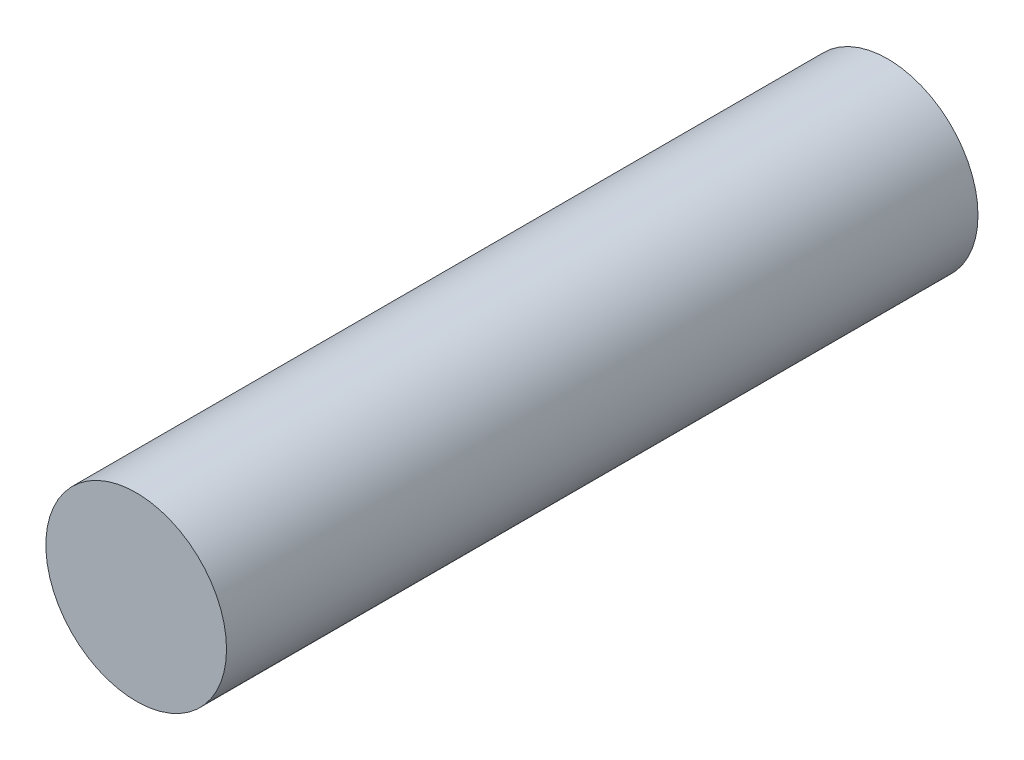
ISO-10303-21;
HEADER;
FILE_DESCRIPTION(('STEP AP214'),'2;1');
FILE_NAME('part.step','',(''),(''),'','','');
FILE_SCHEMA(('AUTOMOTIVE_DESIGN { 1 0 10303 214 1 1 1 1 }'));
ENDSEC;
DATA;
#1=APPLICATION_CONTEXT('core data for automotive mechanical design processes');
#2=APPLICATION_PROTOCOL_DEFINITION('international standard','automotive_design',2000,#1);
#3=PRODUCT_CONTEXT('',#1,'mechanical');
#4=PRODUCT('Part','Part','',(#3));
#5=PRODUCT_RELATED_PRODUCT_CATEGORY('part','',(#4));
#6=PRODUCT_DEFINITION_FORMATION('','',#4);
#7=PRODUCT_DEFINITION_CONTEXT('part definition',#1,'design');
#8=PRODUCT_DEFINITION('design','',#6,#7);
#9=PRODUCT_DEFINITION_SHAPE('','',#8);
#10=(LENGTH_UNIT() NAMED_UNIT(*) SI_UNIT(.MILLI.,.METRE.));
#11=(NAMED_UNIT(*) PLANE_ANGLE_UNIT() SI_UNIT($,.RADIAN.));
#12=(NAMED_UNIT(*) SI_UNIT($,.STERADIAN.) SOLID_ANGLE_UNIT());
#13=UNCERTAINTY_MEASURE_WITH_UNIT(LENGTH_MEASURE(1.E-05),#10,'distance_accuracy_value','');
#14=(GEOMETRIC_REPRESENTATION_CONTEXT(3) GLOBAL_UNCERTAINTY_ASSIGNED_CONTEXT((#13)) GLOBAL_UNIT_ASSIGNED_CONTEXT((#10,
#11,#12)) REPRESENTATION_CONTEXT('',''));
#15=CARTESIAN_POINT('',(0.,0.,0.));
#16=DIRECTION('',(0.,0.,1.));
#17=DIRECTION('',(1.,0.,0.));
#18=AXIS2_PLACEMENT_3D('',#15,#16,#17);
#19=CARTESIAN_POINT('',(0.,0.,145.779956598));
#20=DIRECTION('',(0.,0.,-1.));
#21=DIRECTION('',(-1.,0.,0.));
#22=AXIS2_PLACEMENT_3D('',#19,#20,#21);
#23=CYLINDRICAL_SURFACE('',#22,17.526);
#24=CARTESIAN_POINT('',(0.,0.,145.779956598));
#25=DIRECTION('',(0.,0.,1.));
#26=DIRECTION('',(1.,0.,0.));
#27=AXIS2_PLACEMENT_3D('',#24,#25,#26);
#28=CIRCLE('',#27,17.526);
#29=CARTESIAN_POINT('',(17.526,0.,145.779956598));
#30=VERTEX_POINT('',#29);
#31=EDGE_CURVE('E10',#30,#30,#28,.T.);
#32=ORIENTED_EDGE('',*,*,#31,.F.);
#33=EDGE_LOOP('',(#32));
#34=FACE_BOUND('',#33,.T.);
#35=CARTESIAN_POINT('',(0.,0.,0.));
#36=DIRECTION('',(0.,0.,1.));
#37=DIRECTION('',(1.,0.,0.));
#38=AXIS2_PLACEMENT_3D('',#35,#36,#37);
#39=CIRCLE('',#38,17.526);
#40=CARTESIAN_POINT('',(17.526,0.,0.));
#41=VERTEX_POINT('',#40);
#42=EDGE_CURVE('E44',#41,#41,#39,.T.);
#43=ORIENTED_EDGE('',*,*,#42,.T.);
#44=EDGE_LOOP('',(#43));
#45=FACE_BOUND('',#44,.T.);
#46=ADVANCED_FACE('F41',(#34,#45),#23,.T.);
#47=CARTESIAN_POINT('',(0.,0.,145.779956598));
#48=DIRECTION('',(0.,0.,1.));
#49=DIRECTION('',(1.,0.,0.));
#50=AXIS2_PLACEMENT_3D('',#47,#48,#49);
#51=PLANE('',#50);
#52=ORIENTED_EDGE('',*,*,#31,.T.);
#53=EDGE_LOOP('',(#52));
#54=FACE_BOUND('',#53,.T.);
#55=ADVANCED_FACE('F58',(#54),#51,.T.);
#56=CARTESIAN_POINT('',(0.,0.,0.));
#57=DIRECTION('',(0.,0.,1.));
#58=DIRECTION('',(1.,0.,0.));
#59=AXIS2_PLACEMENT_3D('',#56,#57,#58);
#60=PLANE('',#59);
#61=ORIENTED_EDGE('',*,*,#42,.F.);
#62=EDGE_LOOP('',(#61));
#63=FACE_BOUND('',#62,.T.);
#64=ADVANCED_FACE('F56',(#63),#60,.F.);
#65=CLOSED_SHELL('',(#46,#55,#64));
#66=MANIFOLD_SOLID_BREP('B2',#65);
#67=ADVANCED_BREP_SHAPE_REPRESENTATION('',(#18,#66),#14);
#68=SHAPE_DEFINITION_REPRESENTATION(#9,#67);
ENDSEC;
END-ISO-10303-21;
